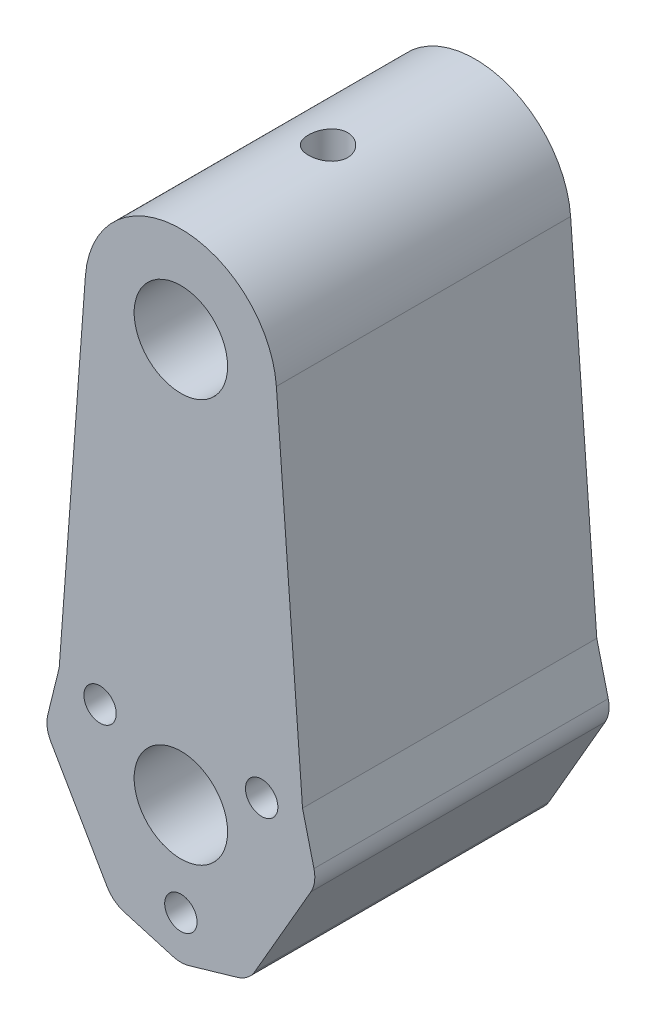
ISO-10303-21;
HEADER;
FILE_DESCRIPTION(('STEP AP214'),'2;1');
FILE_NAME('part.step','',(''),(''),'','','');
FILE_SCHEMA(('AUTOMOTIVE_DESIGN { 1 0 10303 214 1 1 1 1 }'));
ENDSEC;
DATA;
#1=APPLICATION_CONTEXT('core data for automotive mechanical design processes');
#2=APPLICATION_PROTOCOL_DEFINITION('international standard','automotive_design',2000,#1);
#3=PRODUCT_CONTEXT('',#1,'mechanical');
#4=PRODUCT('Part','Part','',(#3));
#5=PRODUCT_RELATED_PRODUCT_CATEGORY('part','',(#4));
#6=PRODUCT_DEFINITION_FORMATION('','',#4);
#7=PRODUCT_DEFINITION_CONTEXT('part definition',#1,'design');
#8=PRODUCT_DEFINITION('design','',#6,#7);
#9=PRODUCT_DEFINITION_SHAPE('','',#8);
#10=(LENGTH_UNIT() NAMED_UNIT(*) SI_UNIT(.MILLI.,.METRE.));
#11=(NAMED_UNIT(*) PLANE_ANGLE_UNIT() SI_UNIT($,.RADIAN.));
#12=(NAMED_UNIT(*) SI_UNIT($,.STERADIAN.) SOLID_ANGLE_UNIT());
#13=UNCERTAINTY_MEASURE_WITH_UNIT(LENGTH_MEASURE(1.E-05),#10,'distance_accuracy_value','');
#14=(GEOMETRIC_REPRESENTATION_CONTEXT(3) GLOBAL_UNCERTAINTY_ASSIGNED_CONTEXT((#13)) GLOBAL_UNIT_ASSIGNED_CONTEXT((#10,
#11,#12)) REPRESENTATION_CONTEXT('',''));
#15=CARTESIAN_POINT('',(0.,0.,0.));
#16=DIRECTION('',(0.,0.,1.));
#17=DIRECTION('',(1.,0.,0.));
#18=AXIS2_PLACEMENT_3D('',#15,#16,#17);
#19=CARTESIAN_POINT('',(12.3430851764876,6.15997573120771,15.));
#20=DIRECTION('',(-0.97112382985435,-0.238575998560248,0.));
#21=DIRECTION('',(0.238575998560248,-0.97112382985435,0.));
#22=AXIS2_PLACEMENT_3D('',#19,#20,#21);
#23=PLANE('',#22);
#24=DIRECTION('',(0.,0.,-1.));
#25=VECTOR('',#24,1.);
#26=CARTESIAN_POINT('',(12.4029017218985,5.91649242601915,15.));
#27=LINE('',#26,#25);
#28=CARTESIAN_POINT('',(12.4029017218985,5.91649242601915,15.));
#29=VERTEX_POINT('',#28);
#30=CARTESIAN_POINT('',(12.4029017218985,5.91649242601915,-15.));
#31=VERTEX_POINT('',#30);
#32=EDGE_CURVE('E11',#29,#31,#27,.T.);
#33=ORIENTED_EDGE('',*,*,#32,.F.);
#34=DIRECTION('',(-0.238575998560248,0.97112382985435,0.));
#35=VECTOR('',#34,1.);
#36=CARTESIAN_POINT('',(12.3430851764876,6.15997573120771,15.));
#37=LINE('',#36,#35);
#38=CARTESIAN_POINT('',(13.5686674410809,1.17124195339267,15.));
#39=VERTEX_POINT('',#38);
#40=EDGE_CURVE('E147',#39,#29,#37,.T.);
#41=ORIENTED_EDGE('',*,*,#40,.F.);
#42=DIRECTION('',(0.,0.,-1.));
#43=VECTOR('',#42,1.);
#44=CARTESIAN_POINT('',(13.5686674410809,1.17124195339267,15.));
#45=LINE('',#44,#43);
#46=CARTESIAN_POINT('',(13.5686674410809,1.17124195339267,-15.));
#47=VERTEX_POINT('',#46);
#48=EDGE_CURVE('E258',#39,#47,#45,.T.);
#49=ORIENTED_EDGE('',*,*,#48,.T.);
#50=DIRECTION('',(-0.238575998560248,0.97112382985435,0.));
#51=VECTOR('',#50,1.);
#52=CARTESIAN_POINT('',(12.3430851764876,6.15997573120771,-15.));
#53=LINE('',#52,#51);
#54=EDGE_CURVE('E59',#47,#31,#53,.T.);
#55=ORIENTED_EDGE('',*,*,#54,.T.);
#56=EDGE_LOOP('',(#33,#41,#49,#55));
#57=FACE_BOUND('',#56,.T.);
#58=ADVANCED_FACE('F41',(#57),#23,.F.);
#59=CARTESIAN_POINT('',(-12.3430851764877,6.15997573120775,15.));
#60=DIRECTION('',(0.971123829854353,-0.238575998560237,0.));
#61=DIRECTION('',(0.238575998560237,0.971123829854353,0.));
#62=AXIS2_PLACEMENT_3D('',#59,#60,#61);
#63=PLANE('',#62);
#64=DIRECTION('',(0.,0.,1.));
#65=VECTOR('',#64,1.);
#66=CARTESIAN_POINT('',(-12.4029017218986,5.91649242601921,15.));
#67=LINE('',#66,#65);
#68=CARTESIAN_POINT('',(-12.4029017218986,5.91649242601921,-15.));
#69=VERTEX_POINT('',#68);
#70=CARTESIAN_POINT('',(-12.4029017218986,5.91649242601921,15.));
#71=VERTEX_POINT('',#70);
#72=EDGE_CURVE('E49',#69,#71,#67,.T.);
#73=ORIENTED_EDGE('',*,*,#72,.F.);
#74=DIRECTION('',(-0.238575998560237,-0.971123829854353,0.));
#75=VECTOR('',#74,1.);
#76=CARTESIAN_POINT('',(-12.3430851764877,6.15997573120775,-15.));
#77=LINE('',#76,#75);
#78=CARTESIAN_POINT('',(-13.568667441081,1.1712419533927,-15.));
#79=VERTEX_POINT('',#78);
#80=EDGE_CURVE('E235',#69,#79,#77,.T.);
#81=ORIENTED_EDGE('',*,*,#80,.T.);
#82=DIRECTION('',(0.,0.,-1.));
#83=VECTOR('',#82,1.);
#84=CARTESIAN_POINT('',(-13.568667441081,1.1712419533927,15.));
#85=LINE('',#84,#83);
#86=CARTESIAN_POINT('',(-13.568667441081,1.1712419533927,15.));
#87=VERTEX_POINT('',#86);
#88=EDGE_CURVE('E255',#87,#79,#85,.T.);
#89=ORIENTED_EDGE('',*,*,#88,.F.);
#90=DIRECTION('',(-0.238575998560237,-0.971123829854353,0.));
#91=VECTOR('',#90,1.);
#92=CARTESIAN_POINT('',(-12.3430851764877,6.15997573120775,15.));
#93=LINE('',#92,#91);
#94=EDGE_CURVE('E213',#71,#87,#93,.T.);
#95=ORIENTED_EDGE('',*,*,#94,.F.);
#96=EDGE_LOOP('',(#73,#81,#89,#95));
#97=FACE_BOUND('',#96,.T.);
#98=ADVANCED_FACE('F280',(#97),#63,.F.);
#99=CARTESIAN_POINT('',(0.,-10.888495471054,15.));
#100=DIRECTION('',(0.,0.,1.));
#101=DIRECTION('',(1.,0.,0.));
#102=AXIS2_PLACEMENT_3D('',#99,#100,#101);
#103=PLANE('',#102);
#104=ORIENTED_EDGE('',*,*,#40,.T.);
#105=DIRECTION('',(-0.0740700617562454,0.997253040081316,0.));
#106=VECTOR('',#105,1.);
#107=CARTESIAN_POINT('',(9.73568280379385,41.8269819217025,15.));
#108=LINE('',#107,#106);
#109=CARTESIAN_POINT('',(9.73568280379385,41.8269819217025,15.));
#110=VERTEX_POINT('',#109);
#111=EDGE_CURVE('E139',#29,#110,#108,.T.);
#112=ORIENTED_EDGE('',*,*,#111,.T.);
#113=CARTESIAN_POINT('',(0.,41.1038729438073,15.));
#114=DIRECTION('',(0.,0.,1.));
#115=DIRECTION('',(-1.,0.,0.));
#116=AXIS2_PLACEMENT_3D('',#113,#114,#115);
#117=CIRCLE('',#116,9.7625);
#118=CARTESIAN_POINT('',(-9.73568280379384,41.8269819217027,15.));
#119=VERTEX_POINT('',#118);
#120=EDGE_CURVE('E145',#110,#119,#117,.T.);
#121=ORIENTED_EDGE('',*,*,#120,.T.);
#122=DIRECTION('',(-0.0740700617562473,-0.997253040081315,0.));
#123=VECTOR('',#122,1.);
#124=CARTESIAN_POINT('',(-12.4214728071686,5.66645792079583,15.));
#125=LINE('',#124,#123);
#126=EDGE_CURVE('E164',#119,#71,#125,.T.);
#127=ORIENTED_EDGE('',*,*,#126,.T.);
#128=ORIENTED_EDGE('',*,*,#94,.T.);
#129=CARTESIAN_POINT('',(-10.6552959515179,0.455513957711989,15.));
#130=DIRECTION('',(0.,0.,1.));
#131=DIRECTION('',(-1.,0.,0.));
#132=AXIS2_PLACEMENT_3D('',#129,#130,#131);
#133=CIRCLE('',#132,3.);
#134=CARTESIAN_POINT('',(-13.2533721628712,-1.04448604228801,15.));
#135=VERTEX_POINT('',#134);
#136=EDGE_CURVE('E215',#87,#135,#133,.T.);
#137=ORIENTED_EDGE('',*,*,#136,.T.);
#138=DIRECTION('',(0.499999999999999,-0.866025403784439,0.));
#139=VECTOR('',#138,1.);
#140=CARTESIAN_POINT('',(-13.2533721628712,-1.04448604228801,15.));
#141=LINE('',#140,#139);
#142=CARTESIAN_POINT('',(-7.53123752795533,-10.955513957712,15.));
#143=VERTEX_POINT('',#142);
#144=EDGE_CURVE('E217',#135,#143,#141,.T.);
#145=ORIENTED_EDGE('',*,*,#144,.T.);
#146=CARTESIAN_POINT('',(-4.93316131660201,-9.45551395771196,15.));
#147=DIRECTION('',(0.,0.,1.));
#148=DIRECTION('',(1.,0.,0.));
#149=AXIS2_PLACEMENT_3D('',#146,#147,#148);
#150=CIRCLE('',#149,3.);
#151=CARTESIAN_POINT('',(-5.77000843492431,-12.3364316761752,15.));
#152=VERTEX_POINT('',#151);
#153=EDGE_CURVE('E219',#143,#152,#150,.T.);
#154=ORIENTED_EDGE('',*,*,#153,.T.);
#155=DIRECTION('',(0.960305906154426,-0.278949039440769,0.));
#156=VECTOR('',#155,1.);
#157=CARTESIAN_POINT('',(-5.77000843492431,-12.3364316761752,15.));
#158=LINE('',#157,#156);
#159=CARTESIAN_POINT('',(-0.836847118322318,-13.7694131895173,15.));
#160=VERTEX_POINT('',#159);
#161=EDGE_CURVE('E221',#152,#160,#158,.T.);
#162=ORIENTED_EDGE('',*,*,#161,.T.);
#163=CARTESIAN_POINT('',(0.,-10.888495471054,15.));
#164=DIRECTION('',(0.,0.,1.));
#165=DIRECTION('',(1.,0.,0.));
#166=AXIS2_PLACEMENT_3D('',#163,#164,#165);
#167=CIRCLE('',#166,3.);
#168=CARTESIAN_POINT('',(0.836847118322291,-13.7694131895173,15.));
#169=VERTEX_POINT('',#168);
#170=EDGE_CURVE('E200',#160,#169,#167,.T.);
#171=ORIENTED_EDGE('',*,*,#170,.T.);
#172=DIRECTION('',(0.960305906154426,0.278949039440768,0.));
#173=VECTOR('',#172,1.);
#174=CARTESIAN_POINT('',(0.836847118322291,-13.7694131895173,15.));
#175=LINE('',#174,#173);
#176=CARTESIAN_POINT('',(5.77000843492429,-12.3364316761752,15.));
#177=VERTEX_POINT('',#176);
#178=EDGE_CURVE('E203',#169,#177,#175,.T.);
#179=ORIENTED_EDGE('',*,*,#178,.T.);
#180=CARTESIAN_POINT('',(4.93316131660199,-9.45551395771197,15.));
#181=DIRECTION('',(0.,0.,1.));
#182=DIRECTION('',(1.,0.,0.));
#183=AXIS2_PLACEMENT_3D('',#180,#181,#182);
#184=CIRCLE('',#183,3.);
#185=CARTESIAN_POINT('',(7.5312375279553,-10.955513957712,15.));
#186=VERTEX_POINT('',#185);
#187=EDGE_CURVE('E206',#177,#186,#184,.T.);
#188=ORIENTED_EDGE('',*,*,#187,.T.);
#189=DIRECTION('',(0.500000000000001,0.866025403784438,0.));
#190=VECTOR('',#189,1.);
#191=CARTESIAN_POINT('',(7.5312375279553,-10.955513957712,15.));
#192=LINE('',#191,#190);
#193=CARTESIAN_POINT('',(13.2533721628712,-1.04448604228807,15.));
#194=VERTEX_POINT('',#193);
#195=EDGE_CURVE('E208',#186,#194,#192,.T.);
#196=ORIENTED_EDGE('',*,*,#195,.T.);
#197=CARTESIAN_POINT('',(10.6552959515179,0.455513957711929,15.));
#198=DIRECTION('',(0.,0.,1.));
#199=DIRECTION('',(1.,0.,0.));
#200=AXIS2_PLACEMENT_3D('',#197,#198,#199);
#201=CIRCLE('',#200,3.);
#202=EDGE_CURVE('E210',#194,#39,#201,.T.);
#203=ORIENTED_EDGE('',*,*,#202,.T.);
#204=EDGE_LOOP('',(#104,#112,#121,#127,#128,#137,#145,#154,#162,#171,#179,#188,#196,#203));
#205=FACE_BOUND('',#204,.T.);
#206=CARTESIAN_POINT('',(0.,41.1038729438073,15.));
#207=DIRECTION('',(0.,0.,1.));
#208=DIRECTION('',(1.,0.,0.));
#209=AXIS2_PLACEMENT_3D('',#206,#207,#208);
#210=CIRCLE('',#209,4.7625);
#211=CARTESIAN_POINT('',(4.7625,41.1038729438073,15.));
#212=VERTEX_POINT('',#211);
#213=EDGE_CURVE('E171',#212,#212,#210,.T.);
#214=ORIENTED_EDGE('',*,*,#213,.F.);
#215=EDGE_LOOP('',(#214));
#216=FACE_BOUND('',#215,.T.);
#217=CARTESIAN_POINT('',(8.23806665349945,4.75625000000004,15.));
#218=DIRECTION('',(0.,0.,1.));
#219=DIRECTION('',(1.,0.,0.));
#220=AXIS2_PLACEMENT_3D('',#217,#218,#219);
#221=CIRCLE('',#220,1.65);
#222=CARTESIAN_POINT('',(9.88806665349945,4.75625000000004,15.));
#223=VERTEX_POINT('',#222);
#224=EDGE_CURVE('E182',#223,#223,#221,.T.);
#225=ORIENTED_EDGE('',*,*,#224,.F.);
#226=EDGE_LOOP('',(#225));
#227=FACE_BOUND('',#226,.T.);
#228=CARTESIAN_POINT('',(0.,0.,15.));
#229=DIRECTION('',(0.,0.,1.));
#230=DIRECTION('',(1.,0.,0.));
#231=AXIS2_PLACEMENT_3D('',#228,#229,#230);
#232=CIRCLE('',#231,4.7625);
#233=CARTESIAN_POINT('',(4.7625,0.,15.));
#234=VERTEX_POINT('',#233);
#235=EDGE_CURVE('E194',#234,#234,#232,.T.);
#236=ORIENTED_EDGE('',*,*,#235,.F.);
#237=EDGE_LOOP('',(#236));
#238=FACE_BOUND('',#237,.T.);
#239=CARTESIAN_POINT('',(-8.23806665349949,4.75624999999998,15.));
#240=DIRECTION('',(0.,0.,1.));
#241=DIRECTION('',(1.,0.,0.));
#242=AXIS2_PLACEMENT_3D('',#239,#240,#241);
#243=CIRCLE('',#242,1.65);
#244=CARTESIAN_POINT('',(-6.58806665349948,4.75624999999998,15.));
#245=VERTEX_POINT('',#244);
#246=EDGE_CURVE('E188',#245,#245,#243,.T.);
#247=ORIENTED_EDGE('',*,*,#246,.F.);
#248=EDGE_LOOP('',(#247));
#249=FACE_BOUND('',#248,.T.);
#250=CARTESIAN_POINT('',(0.,-9.5125,15.));
#251=DIRECTION('',(0.,0.,1.));
#252=DIRECTION('',(1.,0.,0.));
#253=AXIS2_PLACEMENT_3D('',#250,#251,#252);
#254=CIRCLE('',#253,1.65);
#255=CARTESIAN_POINT('',(1.65,-9.5125,15.));
#256=VERTEX_POINT('',#255);
#257=EDGE_CURVE('E176',#256,#256,#254,.T.);
#258=ORIENTED_EDGE('',*,*,#257,.F.);
#259=EDGE_LOOP('',(#258));
#260=FACE_BOUND('',#259,.T.);
#261=ADVANCED_FACE('F141',(#205,#216,#227,#238,#249,#260),#103,.T.);
#262=CARTESIAN_POINT('',(0.,-10.888495471054,-15.));
#263=DIRECTION('',(0.,0.,1.));
#264=DIRECTION('',(1.,0.,0.));
#265=AXIS2_PLACEMENT_3D('',#262,#263,#264);
#266=PLANE('',#265);
#267=DIRECTION('',(-0.0740700617562454,0.997253040081316,0.));
#268=VECTOR('',#267,1.);
#269=CARTESIAN_POINT('',(9.73568280379385,41.8269819217025,-15.));
#270=LINE('',#269,#268);
#271=CARTESIAN_POINT('',(9.73568280379385,41.8269819217025,-15.));
#272=VERTEX_POINT('',#271);
#273=EDGE_CURVE('E155',#31,#272,#270,.T.);
#274=ORIENTED_EDGE('',*,*,#273,.F.);
#275=ORIENTED_EDGE('',*,*,#54,.F.);
#276=CARTESIAN_POINT('',(10.6552959515179,0.455513957711929,-15.));
#277=DIRECTION('',(0.,0.,1.));
#278=DIRECTION('',(1.,0.,0.));
#279=AXIS2_PLACEMENT_3D('',#276,#277,#278);
#280=CIRCLE('',#279,3.);
#281=CARTESIAN_POINT('',(13.2533721628712,-1.04448604228807,-15.));
#282=VERTEX_POINT('',#281);
#283=EDGE_CURVE('E232',#282,#47,#280,.T.);
#284=ORIENTED_EDGE('',*,*,#283,.F.);
#285=DIRECTION('',(0.500000000000001,0.866025403784438,0.));
#286=VECTOR('',#285,1.);
#287=CARTESIAN_POINT('',(7.5312375279553,-10.955513957712,-15.));
#288=LINE('',#287,#286);
#289=CARTESIAN_POINT('',(7.5312375279553,-10.955513957712,-15.));
#290=VERTEX_POINT('',#289);
#291=EDGE_CURVE('E230',#290,#282,#288,.T.);
#292=ORIENTED_EDGE('',*,*,#291,.F.);
#293=CARTESIAN_POINT('',(4.93316131660199,-9.45551395771197,-15.));
#294=DIRECTION('',(0.,0.,1.));
#295=DIRECTION('',(1.,0.,0.));
#296=AXIS2_PLACEMENT_3D('',#293,#294,#295);
#297=CIRCLE('',#296,3.);
#298=CARTESIAN_POINT('',(5.77000843492429,-12.3364316761752,-15.));
#299=VERTEX_POINT('',#298);
#300=EDGE_CURVE('E228',#299,#290,#297,.T.);
#301=ORIENTED_EDGE('',*,*,#300,.F.);
#302=DIRECTION('',(0.960305906154426,0.278949039440768,0.));
#303=VECTOR('',#302,1.);
#304=CARTESIAN_POINT('',(0.836847118322291,-13.7694131895173,-15.));
#305=LINE('',#304,#303);
#306=CARTESIAN_POINT('',(0.836847118322291,-13.7694131895173,-15.));
#307=VERTEX_POINT('',#306);
#308=EDGE_CURVE('E226',#307,#299,#305,.T.);
#309=ORIENTED_EDGE('',*,*,#308,.F.);
#310=CARTESIAN_POINT('',(0.,-10.888495471054,-15.));
#311=DIRECTION('',(0.,0.,1.));
#312=DIRECTION('',(1.,0.,0.));
#313=AXIS2_PLACEMENT_3D('',#310,#311,#312);
#314=CIRCLE('',#313,3.);
#315=CARTESIAN_POINT('',(-0.836847118322318,-13.7694131895173,-15.));
#316=VERTEX_POINT('',#315);
#317=EDGE_CURVE('E197',#316,#307,#314,.T.);
#318=ORIENTED_EDGE('',*,*,#317,.F.);
#319=DIRECTION('',(0.960305906154426,-0.278949039440769,0.));
#320=VECTOR('',#319,1.);
#321=CARTESIAN_POINT('',(-5.77000843492431,-12.3364316761752,-15.));
#322=LINE('',#321,#320);
#323=CARTESIAN_POINT('',(-5.77000843492431,-12.3364316761752,-15.));
#324=VERTEX_POINT('',#323);
#325=EDGE_CURVE('E204',#324,#316,#322,.T.);
#326=ORIENTED_EDGE('',*,*,#325,.F.);
#327=CARTESIAN_POINT('',(-4.93316131660201,-9.45551395771196,-15.));
#328=DIRECTION('',(0.,0.,1.));
#329=DIRECTION('',(1.,0.,0.));
#330=AXIS2_PLACEMENT_3D('',#327,#328,#329);
#331=CIRCLE('',#330,3.);
#332=CARTESIAN_POINT('',(-7.53123752795533,-10.955513957712,-15.));
#333=VERTEX_POINT('',#332);
#334=EDGE_CURVE('E241',#333,#324,#331,.T.);
#335=ORIENTED_EDGE('',*,*,#334,.F.);
#336=DIRECTION('',(0.499999999999999,-0.866025403784439,0.));
#337=VECTOR('',#336,1.);
#338=CARTESIAN_POINT('',(-13.2533721628712,-1.04448604228801,-15.));
#339=LINE('',#338,#337);
#340=CARTESIAN_POINT('',(-13.2533721628712,-1.04448604228801,-15.));
#341=VERTEX_POINT('',#340);
#342=EDGE_CURVE('E239',#341,#333,#339,.T.);
#343=ORIENTED_EDGE('',*,*,#342,.F.);
#344=CARTESIAN_POINT('',(-10.6552959515179,0.455513957711989,-15.));
#345=DIRECTION('',(0.,0.,1.));
#346=DIRECTION('',(-1.,0.,0.));
#347=AXIS2_PLACEMENT_3D('',#344,#345,#346);
#348=CIRCLE('',#347,3.);
#349=EDGE_CURVE('E237',#79,#341,#348,.T.);
#350=ORIENTED_EDGE('',*,*,#349,.F.);
#351=ORIENTED_EDGE('',*,*,#80,.F.);
#352=DIRECTION('',(-0.0740700617562473,-0.997253040081315,0.));
#353=VECTOR('',#352,1.);
#354=CARTESIAN_POINT('',(-12.4214728071686,5.66645792079583,-15.));
#355=LINE('',#354,#353);
#356=CARTESIAN_POINT('',(-9.73568280379384,41.8269819217027,-15.));
#357=VERTEX_POINT('',#356);
#358=EDGE_CURVE('E149',#357,#69,#355,.T.);
#359=ORIENTED_EDGE('',*,*,#358,.F.);
#360=CARTESIAN_POINT('',(0.,41.1038729438073,-15.));
#361=DIRECTION('',(0.,0.,1.));
#362=DIRECTION('',(-1.,0.,0.));
#363=AXIS2_PLACEMENT_3D('',#360,#361,#362);
#364=CIRCLE('',#363,9.7625);
#365=EDGE_CURVE('E170',#272,#357,#364,.T.);
#366=ORIENTED_EDGE('',*,*,#365,.F.);
#367=EDGE_LOOP('',(#274,#275,#284,#292,#301,#309,#318,#326,#335,#343,#350,#351,#359,#366));
#368=FACE_BOUND('',#367,.T.);
#369=CARTESIAN_POINT('',(0.,41.1038729438073,-15.));
#370=DIRECTION('',(0.,0.,1.));
#371=DIRECTION('',(1.,0.,0.));
#372=AXIS2_PLACEMENT_3D('',#369,#370,#371);
#373=CIRCLE('',#372,4.7625);
#374=CARTESIAN_POINT('',(4.7625,41.1038729438073,-15.));
#375=VERTEX_POINT('',#374);
#376=EDGE_CURVE('E503',#375,#375,#373,.T.);
#377=ORIENTED_EDGE('',*,*,#376,.T.);
#378=EDGE_LOOP('',(#377));
#379=FACE_BOUND('',#378,.T.);
#380=CARTESIAN_POINT('',(0.,0.,-15.));
#381=DIRECTION('',(0.,0.,1.));
#382=DIRECTION('',(1.,0.,0.));
#383=AXIS2_PLACEMENT_3D('',#380,#381,#382);
#384=CIRCLE('',#383,4.7625);
#385=CARTESIAN_POINT('',(4.7625,0.,-15.));
#386=VERTEX_POINT('',#385);
#387=EDGE_CURVE('E191',#386,#386,#384,.T.);
#388=ORIENTED_EDGE('',*,*,#387,.T.);
#389=EDGE_LOOP('',(#388));
#390=FACE_BOUND('',#389,.T.);
#391=CARTESIAN_POINT('',(-8.23806665349949,4.75624999999998,-15.));
#392=DIRECTION('',(0.,0.,1.));
#393=DIRECTION('',(1.,0.,0.));
#394=AXIS2_PLACEMENT_3D('',#391,#392,#393);
#395=CIRCLE('',#394,1.65);
#396=CARTESIAN_POINT('',(-6.58806665349948,4.75624999999998,-15.));
#397=VERTEX_POINT('',#396);
#398=EDGE_CURVE('E185',#397,#397,#395,.T.);
#399=ORIENTED_EDGE('',*,*,#398,.T.);
#400=EDGE_LOOP('',(#399));
#401=FACE_BOUND('',#400,.T.);
#402=CARTESIAN_POINT('',(8.23806665349945,4.75625000000004,-15.));
#403=DIRECTION('',(0.,0.,1.));
#404=DIRECTION('',(1.,0.,0.));
#405=AXIS2_PLACEMENT_3D('',#402,#403,#404);
#406=CIRCLE('',#405,1.65);
#407=CARTESIAN_POINT('',(9.88806665349945,4.75625000000004,-15.));
#408=VERTEX_POINT('',#407);
#409=EDGE_CURVE('E179',#408,#408,#406,.T.);
#410=ORIENTED_EDGE('',*,*,#409,.T.);
#411=EDGE_LOOP('',(#410));
#412=FACE_BOUND('',#411,.T.);
#413=CARTESIAN_POINT('',(0.,-9.5125,-15.));
#414=DIRECTION('',(0.,0.,1.));
#415=DIRECTION('',(1.,0.,0.));
#416=AXIS2_PLACEMENT_3D('',#413,#414,#415);
#417=CIRCLE('',#416,1.65);
#418=CARTESIAN_POINT('',(1.65,-9.5125,-15.));
#419=VERTEX_POINT('',#418);
#420=EDGE_CURVE('E158',#419,#419,#417,.T.);
#421=ORIENTED_EDGE('',*,*,#420,.T.);
#422=EDGE_LOOP('',(#421));
#423=FACE_BOUND('',#422,.T.);
#424=ADVANCED_FACE('F339',(#368,#379,#390,#401,#412,#423),#266,.F.);
#425=CARTESIAN_POINT('',(0.,-10.888495471054,15.));
#426=DIRECTION('',(0.,0.,-1.));
#427=DIRECTION('',(-1.,0.,0.));
#428=AXIS2_PLACEMENT_3D('',#425,#426,#427);
#429=CYLINDRICAL_SURFACE('',#428,3.);
#430=ORIENTED_EDGE('',*,*,#317,.T.);
#431=DIRECTION('',(0.,0.,-1.));
#432=VECTOR('',#431,1.);
#433=CARTESIAN_POINT('',(0.836847118322291,-13.7694131895173,15.));
#434=LINE('',#433,#432);
#435=EDGE_CURVE('E269',#169,#307,#434,.T.);
#436=ORIENTED_EDGE('',*,*,#435,.F.);
#437=ORIENTED_EDGE('',*,*,#170,.F.);
#438=DIRECTION('',(0.,0.,-1.));
#439=VECTOR('',#438,1.);
#440=CARTESIAN_POINT('',(-0.836847118322318,-13.7694131895173,15.));
#441=LINE('',#440,#439);
#442=EDGE_CURVE('E223',#160,#316,#441,.T.);
#443=ORIENTED_EDGE('',*,*,#442,.T.);
#444=EDGE_LOOP('',(#430,#436,#437,#443));
#445=FACE_BOUND('',#444,.T.);
#446=ADVANCED_FACE('F43',(#445),#429,.T.);
#447=CARTESIAN_POINT('',(0.836847118322291,-13.7694131895173,15.));
#448=DIRECTION('',(-0.278949039440768,0.960305906154426,0.));
#449=DIRECTION('',(-0.960305906154426,-0.278949039440768,0.));
#450=AXIS2_PLACEMENT_3D('',#447,#448,#449);
#451=PLANE('',#450);
#452=ORIENTED_EDGE('',*,*,#308,.T.);
#453=DIRECTION('',(0.,0.,-1.));
#454=VECTOR('',#453,1.);
#455=CARTESIAN_POINT('',(5.77000843492429,-12.3364316761752,15.));
#456=LINE('',#455,#454);
#457=EDGE_CURVE('E266',#177,#299,#456,.T.);
#458=ORIENTED_EDGE('',*,*,#457,.F.);
#459=ORIENTED_EDGE('',*,*,#178,.F.);
#460=ORIENTED_EDGE('',*,*,#435,.T.);
#461=EDGE_LOOP('',(#452,#458,#459,#460));
#462=FACE_BOUND('',#461,.T.);
#463=ADVANCED_FACE('F307',(#462),#451,.F.);
#464=CARTESIAN_POINT('',(4.93316131660199,-9.45551395771197,15.));
#465=DIRECTION('',(0.,0.,-1.));
#466=DIRECTION('',(-1.,0.,0.));
#467=AXIS2_PLACEMENT_3D('',#464,#465,#466);
#468=CYLINDRICAL_SURFACE('',#467,3.);
#469=ORIENTED_EDGE('',*,*,#300,.T.);
#470=DIRECTION('',(0.,0.,-1.));
#471=VECTOR('',#470,1.);
#472=CARTESIAN_POINT('',(7.5312375279553,-10.955513957712,15.));
#473=LINE('',#472,#471);
#474=EDGE_CURVE('E263',#186,#290,#473,.T.);
#475=ORIENTED_EDGE('',*,*,#474,.F.);
#476=ORIENTED_EDGE('',*,*,#187,.F.);
#477=ORIENTED_EDGE('',*,*,#457,.T.);
#478=EDGE_LOOP('',(#469,#475,#476,#477));
#479=FACE_BOUND('',#478,.T.);
#480=ADVANCED_FACE('F310',(#479),#468,.T.);
#481=CARTESIAN_POINT('',(7.5312375279553,-10.955513957712,15.));
#482=DIRECTION('',(-0.866025403784438,0.500000000000001,0.));
#483=DIRECTION('',(-0.500000000000001,-0.866025403784438,0.));
#484=AXIS2_PLACEMENT_3D('',#481,#482,#483);
#485=PLANE('',#484);
#486=ORIENTED_EDGE('',*,*,#291,.T.);
#487=DIRECTION('',(0.,0.,-1.));
#488=VECTOR('',#487,1.);
#489=CARTESIAN_POINT('',(13.2533721628712,-1.04448604228807,15.));
#490=LINE('',#489,#488);
#491=EDGE_CURVE('E260',#194,#282,#490,.T.);
#492=ORIENTED_EDGE('',*,*,#491,.F.);
#493=ORIENTED_EDGE('',*,*,#195,.F.);
#494=ORIENTED_EDGE('',*,*,#474,.T.);
#495=EDGE_LOOP('',(#486,#492,#493,#494));
#496=FACE_BOUND('',#495,.T.);
#497=ADVANCED_FACE('F315',(#496),#485,.F.);
#498=CARTESIAN_POINT('',(10.6552959515179,0.455513957711929,15.));
#499=DIRECTION('',(0.,0.,-1.));
#500=DIRECTION('',(-1.,0.,0.));
#501=AXIS2_PLACEMENT_3D('',#498,#499,#500);
#502=CYLINDRICAL_SURFACE('',#501,3.);
#503=ORIENTED_EDGE('',*,*,#283,.T.);
#504=ORIENTED_EDGE('',*,*,#48,.F.);
#505=ORIENTED_EDGE('',*,*,#202,.F.);
#506=ORIENTED_EDGE('',*,*,#491,.T.);
#507=EDGE_LOOP('',(#503,#504,#505,#506));
#508=FACE_BOUND('',#507,.T.);
#509=ADVANCED_FACE('F319',(#508),#502,.T.);
#510=CARTESIAN_POINT('',(-10.6552959515179,0.455513957711989,15.));
#511=DIRECTION('',(0.,0.,-1.));
#512=DIRECTION('',(-1.,0.,0.));
#513=AXIS2_PLACEMENT_3D('',#510,#511,#512);
#514=CYLINDRICAL_SURFACE('',#513,3.);
#515=ORIENTED_EDGE('',*,*,#349,.T.);
#516=DIRECTION('',(0.,0.,-1.));
#517=VECTOR('',#516,1.);
#518=CARTESIAN_POINT('',(-13.2533721628712,-1.04448604228801,15.));
#519=LINE('',#518,#517);
#520=EDGE_CURVE('E252',#135,#341,#519,.T.);
#521=ORIENTED_EDGE('',*,*,#520,.F.);
#522=ORIENTED_EDGE('',*,*,#136,.F.);
#523=ORIENTED_EDGE('',*,*,#88,.T.);
#524=EDGE_LOOP('',(#515,#521,#522,#523));
#525=FACE_BOUND('',#524,.T.);
#526=ADVANCED_FACE('F283',(#525),#514,.T.);
#527=CARTESIAN_POINT('',(-13.2533721628712,-1.04448604228801,15.));
#528=DIRECTION('',(0.866025403784439,0.499999999999999,0.));
#529=DIRECTION('',(-0.499999999999999,0.866025403784439,0.));
#530=AXIS2_PLACEMENT_3D('',#527,#528,#529);
#531=PLANE('',#530);
#532=ORIENTED_EDGE('',*,*,#342,.T.);
#533=DIRECTION('',(0.,0.,-1.));
#534=VECTOR('',#533,1.);
#535=CARTESIAN_POINT('',(-7.53123752795533,-10.955513957712,15.));
#536=LINE('',#535,#534);
#537=EDGE_CURVE('E249',#143,#333,#536,.T.);
#538=ORIENTED_EDGE('',*,*,#537,.F.);
#539=ORIENTED_EDGE('',*,*,#144,.F.);
#540=ORIENTED_EDGE('',*,*,#520,.T.);
#541=EDGE_LOOP('',(#532,#538,#539,#540));
#542=FACE_BOUND('',#541,.T.);
#543=ADVANCED_FACE('F288',(#542),#531,.F.);
#544=CARTESIAN_POINT('',(-4.93316131660201,-9.45551395771196,15.));
#545=DIRECTION('',(0.,0.,-1.));
#546=DIRECTION('',(-1.,0.,0.));
#547=AXIS2_PLACEMENT_3D('',#544,#545,#546);
#548=CYLINDRICAL_SURFACE('',#547,3.);
#549=ORIENTED_EDGE('',*,*,#334,.T.);
#550=DIRECTION('',(0.,0.,-1.));
#551=VECTOR('',#550,1.);
#552=CARTESIAN_POINT('',(-5.77000843492431,-12.3364316761752,15.));
#553=LINE('',#552,#551);
#554=EDGE_CURVE('E246',#152,#324,#553,.T.);
#555=ORIENTED_EDGE('',*,*,#554,.F.);
#556=ORIENTED_EDGE('',*,*,#153,.F.);
#557=ORIENTED_EDGE('',*,*,#537,.T.);
#558=EDGE_LOOP('',(#549,#555,#556,#557));
#559=FACE_BOUND('',#558,.T.);
#560=ADVANCED_FACE('F294',(#559),#548,.T.);
#561=CARTESIAN_POINT('',(-5.77000843492431,-12.3364316761752,15.));
#562=DIRECTION('',(0.278949039440769,0.960305906154426,0.));
#563=DIRECTION('',(-0.960305906154426,0.278949039440769,0.));
#564=AXIS2_PLACEMENT_3D('',#561,#562,#563);
#565=PLANE('',#564);
#566=ORIENTED_EDGE('',*,*,#325,.T.);
#567=ORIENTED_EDGE('',*,*,#442,.F.);
#568=ORIENTED_EDGE('',*,*,#161,.F.);
#569=ORIENTED_EDGE('',*,*,#554,.T.);
#570=EDGE_LOOP('',(#566,#567,#568,#569));
#571=FACE_BOUND('',#570,.T.);
#572=ADVANCED_FACE('F298',(#571),#565,.F.);
#573=CARTESIAN_POINT('',(0.,0.,15.));
#574=DIRECTION('',(0.,0.,-1.));
#575=DIRECTION('',(-1.,0.,0.));
#576=AXIS2_PLACEMENT_3D('',#573,#574,#575);
#577=CYLINDRICAL_SURFACE('',#576,4.7625);
#578=ORIENTED_EDGE('',*,*,#235,.T.);
#579=EDGE_LOOP('',(#578));
#580=FACE_BOUND('',#579,.T.);
#581=ORIENTED_EDGE('',*,*,#387,.F.);
#582=EDGE_LOOP('',(#581));
#583=FACE_BOUND('',#582,.T.);
#584=ADVANCED_FACE('F355',(#580,#583),#577,.F.);
#585=CARTESIAN_POINT('',(-8.23806665349949,4.75624999999998,15.));
#586=DIRECTION('',(0.,0.,-1.));
#587=DIRECTION('',(-1.,0.,0.));
#588=AXIS2_PLACEMENT_3D('',#585,#586,#587);
#589=CYLINDRICAL_SURFACE('',#588,1.65);
#590=ORIENTED_EDGE('',*,*,#246,.T.);
#591=EDGE_LOOP('',(#590));
#592=FACE_BOUND('',#591,.T.);
#593=ORIENTED_EDGE('',*,*,#398,.F.);
#594=EDGE_LOOP('',(#593));
#595=FACE_BOUND('',#594,.T.);
#596=ADVANCED_FACE('F386',(#592,#595),#589,.F.);
#597=CARTESIAN_POINT('',(8.23806665349945,4.75625000000004,15.));
#598=DIRECTION('',(0.,0.,-1.));
#599=DIRECTION('',(-1.,0.,0.));
#600=AXIS2_PLACEMENT_3D('',#597,#598,#599);
#601=CYLINDRICAL_SURFACE('',#600,1.65);
#602=ORIENTED_EDGE('',*,*,#224,.T.);
#603=EDGE_LOOP('',(#602));
#604=FACE_BOUND('',#603,.T.);
#605=ORIENTED_EDGE('',*,*,#409,.F.);
#606=EDGE_LOOP('',(#605));
#607=FACE_BOUND('',#606,.T.);
#608=ADVANCED_FACE('F394',(#604,#607),#601,.F.);
#609=CARTESIAN_POINT('',(0.,-9.5125,15.));
#610=DIRECTION('',(0.,0.,-1.));
#611=DIRECTION('',(-1.,0.,0.));
#612=AXIS2_PLACEMENT_3D('',#609,#610,#611);
#613=CYLINDRICAL_SURFACE('',#612,1.65);
#614=ORIENTED_EDGE('',*,*,#257,.T.);
#615=EDGE_LOOP('',(#614));
#616=FACE_BOUND('',#615,.T.);
#617=ORIENTED_EDGE('',*,*,#420,.F.);
#618=EDGE_LOOP('',(#617));
#619=FACE_BOUND('',#618,.T.);
#620=ADVANCED_FACE('F402',(#616,#619),#613,.F.);
#621=CARTESIAN_POINT('',(9.73568280379385,41.8269819217025,15.));
#622=DIRECTION('',(-0.997253040081316,-0.0740700617562454,0.));
#623=DIRECTION('',(0.0740700617562454,-0.997253040081316,0.));
#624=AXIS2_PLACEMENT_3D('',#621,#622,#623);
#625=PLANE('',#624);
#626=ORIENTED_EDGE('',*,*,#111,.F.);
#627=ORIENTED_EDGE('',*,*,#32,.T.);
#628=ORIENTED_EDGE('',*,*,#273,.T.);
#629=DIRECTION('',(0.,0.,-1.));
#630=VECTOR('',#629,1.);
#631=CARTESIAN_POINT('',(9.73568280379385,41.8269819217025,15.));
#632=LINE('',#631,#630);
#633=EDGE_CURVE('E152',#110,#272,#632,.T.);
#634=ORIENTED_EDGE('',*,*,#633,.F.);
#635=EDGE_LOOP('',(#626,#627,#628,#634));
#636=FACE_BOUND('',#635,.T.);
#637=ADVANCED_FACE('F153',(#636),#625,.F.);
#638=CARTESIAN_POINT('',(-12.4214728071686,5.66645792079583,15.));
#639=DIRECTION('',(0.997253040081315,-0.0740700617562473,0.));
#640=DIRECTION('',(0.0740700617562473,0.997253040081315,0.));
#641=AXIS2_PLACEMENT_3D('',#638,#639,#640);
#642=PLANE('',#641);
#643=ORIENTED_EDGE('',*,*,#358,.T.);
#644=ORIENTED_EDGE('',*,*,#72,.T.);
#645=ORIENTED_EDGE('',*,*,#126,.F.);
#646=DIRECTION('',(0.,0.,-1.));
#647=VECTOR('',#646,1.);
#648=CARTESIAN_POINT('',(-9.73568280379384,41.8269819217027,15.));
#649=LINE('',#648,#647);
#650=EDGE_CURVE('E159',#119,#357,#649,.T.);
#651=ORIENTED_EDGE('',*,*,#650,.T.);
#652=EDGE_LOOP('',(#643,#644,#645,#651));
#653=FACE_BOUND('',#652,.T.);
#654=ADVANCED_FACE('F273',(#653),#642,.F.);
#655=CARTESIAN_POINT('',(0.,41.1038729438073,15.));
#656=DIRECTION('',(0.,0.,-1.));
#657=DIRECTION('',(-1.,0.,0.));
#658=AXIS2_PLACEMENT_3D('',#655,#656,#657);
#659=CYLINDRICAL_SURFACE('',#658,9.7625);
#660=CARTESIAN_POINT('',(0.,50.8663729438073,2.));
#661=CARTESIAN_POINT('',(0.111096270545489,50.8663708897027,1.99999598237589));
#662=CARTESIAN_POINT('',(0.222242750978251,50.8644571317093,1.99071194232444));
#663=CARTESIAN_POINT('',(0.441390170885254,50.857007427361,1.95385284594981));
#664=CARTESIAN_POINT('',(0.549388606973715,50.8514686762314,1.92626362608736));
#665=CARTESIAN_POINT('',(0.759040095856698,50.8373870188624,1.85368536104701));
#666=CARTESIAN_POINT('',(0.860699253026225,50.8288470569128,1.80871336466158));
#667=CARTESIAN_POINT('',(1.05502317807572,50.809689668082,1.70269768599065));
#668=CARTESIAN_POINT('',(1.14768840421541,50.7990723471299,1.64165482313862));
#669=CARTESIAN_POINT('',(1.32271377765976,50.7767591346319,1.50431323319022));
#670=CARTESIAN_POINT('',(1.40492809008899,50.765051256787,1.42783058663106));
#671=CARTESIAN_POINT('',(1.55545465865683,50.7419629845632,1.26217572955875));
#672=CARTESIAN_POINT('',(1.62376579188251,50.7305826166997,1.17300249505716));
#673=CARTESIAN_POINT('',(1.74517335108151,50.7093205772933,0.983441373152901));
#674=CARTESIAN_POINT('',(1.79811770132923,50.6994543128511,0.882954204908762));
#675=CARTESIAN_POINT('',(1.88631423985942,50.6825082807321,0.67427451029944));
#676=CARTESIAN_POINT('',(1.92156826735882,50.6754282233972,0.566082786293043));
#677=CARTESIAN_POINT('',(1.97290783060349,50.6649777213864,0.346637518191935));
#678=CARTESIAN_POINT('',(1.98924983369709,50.6615576919701,0.235446385154278));
#679=CARTESIAN_POINT('',(2.00309828466899,50.6586653126112,0.0118520223544458));
#680=CARTESIAN_POINT('',(2.00060675561089,50.6591925386615,-0.100551075925404));
#681=CARTESIAN_POINT('',(1.97706598021315,50.6640900890154,-0.321494743199933));
#682=CARTESIAN_POINT('',(1.95631171707468,50.6683993227242,-0.430068298573962));
#683=CARTESIAN_POINT('',(1.89730066371993,50.680279056291,-0.642159111435934));
#684=CARTESIAN_POINT('',(1.85904300060054,50.6878497187971,-0.745676116466248));
#685=CARTESIAN_POINT('',(1.76583221245497,50.7054611757846,-0.945560209532713));
#686=CARTESIAN_POINT('',(1.71076305044425,50.7155190428624,-1.0418716200873));
#687=CARTESIAN_POINT('',(1.58557427561955,50.7369608059205,-1.2239969183631));
#688=CARTESIAN_POINT('',(1.51545285160933,50.748344861402,-1.3098095408422));
#689=CARTESIAN_POINT('',(1.36057516012576,50.7714203275509,-1.4702025395351));
#690=CARTESIAN_POINT('',(1.27556735743573,50.7831134808894,-1.54453999158912));
#691=CARTESIAN_POINT('',(1.09416351739471,50.8052928852535,-1.67793973385202));
#692=CARTESIAN_POINT('',(0.997767319893455,50.8157791193026,-1.73700180921235));
#693=CARTESIAN_POINT('',(0.796046485684007,50.8343909231525,-1.83822294735157));
#694=CARTESIAN_POINT('',(0.690707007592007,50.8425124657823,-1.88035322040159));
#695=CARTESIAN_POINT('',(0.474241593669872,50.8554494227383,-1.94625033332431));
#696=CARTESIAN_POINT('',(0.363116395909465,50.860265257659,-1.97001950937933));
#697=CARTESIAN_POINT('',(0.140320551261761,50.865989285162,-1.99817342197341));
#698=CARTESIAN_POINT('',(0.0286935633109393,50.866964455304,-2.00289044761031));
#699=CARTESIAN_POINT('',(-0.193753469165401,50.865083730412,-1.9937025048477));
#700=CARTESIAN_POINT('',(-0.304573561003624,50.8622280618496,-1.97979863727872));
#701=CARTESIAN_POINT('',(-0.521181737952826,50.8530485272635,-1.93403953639928));
#702=CARTESIAN_POINT('',(-0.627007571019496,50.8467578011727,-1.90235575630572));
#703=CARTESIAN_POINT('',(-0.831844103067045,50.8314112147829,-1.82212431390724));
#704=CARTESIAN_POINT('',(-0.930854272293403,50.8223551398411,-1.77357534250716));
#705=CARTESIAN_POINT('',(-1.12064346969464,50.8023159356318,-1.66027948684931));
#706=CARTESIAN_POINT('',(-1.21130130635044,50.791309685088,-1.5953337640621));
#707=CARTESIAN_POINT('',(-1.38055115683262,50.7686434620477,-1.45135309377027));
#708=CARTESIAN_POINT('',(-1.45914180678819,50.7569834158601,-1.37231655585657));
#709=CARTESIAN_POINT('',(-1.60331678317282,50.7340965751494,-1.20088193776066));
#710=CARTESIAN_POINT('',(-1.66867247222937,50.7228797192939,-1.10829001533239));
#711=CARTESIAN_POINT('',(-1.78290481866831,50.7023644241991,-0.913247569060954));
#712=CARTESIAN_POINT('',(-1.83178215151766,50.693065906331,-0.810797449538076));
#713=CARTESIAN_POINT('',(-1.91136314664715,50.6775213207837,-0.599473328201778));
#714=CARTESIAN_POINT('',(-1.94216335457914,50.6712590689408,-0.490636931582011));
#715=CARTESIAN_POINT('',(-1.98500632807858,50.662462959053,-0.269190867773612));
#716=CARTESIAN_POINT('',(-1.99705167645767,50.6599285876285,-0.156581722328595));
#717=CARTESIAN_POINT('',(-2.00194375923575,50.6589046733775,0.0669153792629898));
#718=CARTESIAN_POINT('',(-1.99515206862095,50.6603389514871,0.177795228752474));
#719=CARTESIAN_POINT('',(-1.96336346885978,50.6669199992583,0.396795703595135));
#720=CARTESIAN_POINT('',(-1.9383667222359,50.6720667357777,0.504916353571667));
#721=CARTESIAN_POINT('',(-1.87104231535894,50.6854579455819,0.715084818079543));
#722=CARTESIAN_POINT('',(-1.82876108623485,50.693694114907,0.817148069814867));
#723=CARTESIAN_POINT('',(-1.72811030095019,50.7123405231956,1.01278797702857));
#724=CARTESIAN_POINT('',(-1.66973931161348,50.7227509558089,1.10636387551883));
#725=CARTESIAN_POINT('',(-1.5373399717502,50.7448045993152,1.28416876154697));
#726=CARTESIAN_POINT('',(-1.46305135104944,50.7564664592457,1.36820166627763));
#727=CARTESIAN_POINT('',(-1.30146046782362,50.7795773202466,1.52272801183216));
#728=CARTESIAN_POINT('',(-1.21415521599909,50.7910262717409,1.59321833403804));
#729=CARTESIAN_POINT('',(-1.0278459801838,50.8125711440666,1.71939878944926));
#730=CARTESIAN_POINT('',(-0.928723101412061,50.822650669256,1.77491629783254));
#731=CARTESIAN_POINT('',(-0.722373752168651,50.8401589360042,1.86841723238997));
#732=CARTESIAN_POINT('',(-0.615154557684236,50.8475900240943,1.90641618891546));
#733=CARTESIAN_POINT('',(-0.423105621854215,50.8575498798265,1.95658862073416));
#734=CARTESIAN_POINT('',(-0.339356227616943,50.8608388851262,1.97283836087625));
#735=CARTESIAN_POINT('',(-0.170414370626046,50.8652511673339,1.99454540392492));
#736=CARTESIAN_POINT('',(-0.0852219581296774,50.8663745195111,2.00000308191978));
#737=CARTESIAN_POINT('',(0.,50.8663729438073,2.));
#738=B_SPLINE_CURVE_WITH_KNOTS('',3,(#660,#661,#662,#663,#664,#665,#666,#667,#668,#669,#670,
#671,#672,#673,#674,#675,#676,#677,#678,#679,#680,#681,#682,#683,#684,#685,#686,#687,#688,#689,
#690,#691,#692,#693,#694,#695,#696,#697,#698,#699,#700,#701,#702,#703,#704,#705,#706,#707,#708,
#709,#710,#711,#712,#713,#714,#715,#716,#717,#718,#719,#720,#721,#722,#723,#724,#725,#726,#727,
#728,#729,#730,#731,#732,#733,#734,#735,#736,#737),.UNSPECIFIED.,.T.,.F.,(4,2,2,2,2,2,2,2,2,2,2,
2,2,2,2,2,2,2,2,2,2,2,2,2,2,2,2,2,2,2,2,2,2,2,2,2,2,2,4),(0.,0.332976999945412,
0.666211940062739,0.999120873793139,1.33201283619775,1.66913290520048,2.00628019145962,
2.34665835830555,2.68700112958115,3.02267230740182,3.35830742855041,3.68861881682455,
4.01894667968516,4.35160816878593,4.68430970856583,5.02329888406183,5.36229282718948,
5.70186075924901,6.04138547911238,6.37496228086971,6.70851936309415,7.03891387143632,
7.3693340311049,7.70397162848387,8.03864701984408,8.37868620755667,8.71871145497301,
9.05690378216453,9.39504953132898,9.72674976632392,10.0584470401589,10.3892590737087,
10.7201005834719,11.0568326170164,11.3936421013081,11.7341831235457,12.0744216698792,
12.3298572315544,12.5852839151699),.UNSPECIFIED.);
#739=CARTESIAN_POINT('',(0.,50.8663729438073,2.));
#740=VERTEX_POINT('',#739);
#741=EDGE_CURVE('E491',#740,#740,#738,.T.);
#742=ORIENTED_EDGE('',*,*,#741,.F.);
#743=EDGE_LOOP('',(#742));
#744=FACE_BOUND('',#743,.T.);
#745=ORIENTED_EDGE('',*,*,#365,.T.);
#746=ORIENTED_EDGE('',*,*,#650,.F.);
#747=ORIENTED_EDGE('',*,*,#120,.F.);
#748=ORIENTED_EDGE('',*,*,#633,.T.);
#749=EDGE_LOOP('',(#745,#746,#747,#748));
#750=FACE_BOUND('',#749,.T.);
#751=ADVANCED_FACE('F161',(#744,#750),#659,.T.);
#752=CARTESIAN_POINT('',(0.,41.1038729438073,15.));
#753=DIRECTION('',(0.,0.,-1.));
#754=DIRECTION('',(-1.,0.,0.));
#755=AXIS2_PLACEMENT_3D('',#752,#753,#754);
#756=CYLINDRICAL_SURFACE('',#755,4.7625);
#757=CARTESIAN_POINT('',(0.,45.8663729438073,2.));
#758=CARTESIAN_POINT('',(0.107060821648597,45.8663640636299,1.9999882228804));
#759=CARTESIAN_POINT('',(0.214286276303952,45.8627211434596,1.99135261624896));
#760=CARTESIAN_POINT('',(0.425694890287393,45.8485003940333,1.95711852511219));
#761=CARTESIAN_POINT('',(0.529869450297381,45.8379046268501,1.9314761623581));
#762=CARTESIAN_POINT('',(0.731770229337581,45.8109159061061,1.86434594730262));
#763=CARTESIAN_POINT('',(0.829517115659118,45.7945427314765,1.82291211872848));
#764=CARTESIAN_POINT('',(1.01657676786598,45.7575898329262,1.72559987470608));
#765=CARTESIAN_POINT('',(1.10589200384987,45.7370113466008,1.66972570767537));
#766=CARTESIAN_POINT('',(1.27823678405331,45.6925332523731,1.54212011099487));
#767=CARTESIAN_POINT('',(1.36078156121193,45.6685237698797,1.46977259998615));
#768=CARTESIAN_POINT('',(1.51298424679324,45.6203616439201,1.31257714247716));
#769=CARTESIAN_POINT('',(1.58263527034026,45.5962089310359,1.22772256076413));
#770=CARTESIAN_POINT('',(1.71052779306918,45.5491380856812,1.04276343427836));
#771=CARTESIAN_POINT('',(1.76802166954306,45.5263426639583,0.942107419385259));
#772=CARTESIAN_POINT('',(1.86504577940939,45.4863135521565,0.731457915184667));
#773=CARTESIAN_POINT('',(1.90458541117603,45.4690769536145,0.621469346990567));
#774=CARTESIAN_POINT('',(1.96256875590968,45.4433082134923,0.400857159213864));
#775=CARTESIAN_POINT('',(1.98194627637735,45.434392958355,0.290525464951525));
#776=CARTESIAN_POINT('',(2.00196777969157,45.4251766548723,0.0678441926301817));
#777=CARTESIAN_POINT('',(2.00262232972594,45.4248707474388,-0.0445042113719514));
#778=CARTESIAN_POINT('',(1.98588183444613,45.4325839916661,-0.258659627422966));
#779=CARTESIAN_POINT('',(1.96989256584013,45.4399547779397,-0.360604603322714));
#780=CARTESIAN_POINT('',(1.92267913444267,45.4610937378124,-0.560202412206314));
#781=CARTESIAN_POINT('',(1.89145199942968,45.474863159472,-0.657854403769765));
#782=CARTESIAN_POINT('',(1.81403841564596,45.5075602765797,-0.848580392670132));
#783=CARTESIAN_POINT('',(1.76754563430415,45.5265922222861,-0.94151137604095));
#784=CARTESIAN_POINT('',(1.66113746764038,45.5676466283526,-1.11861779311222));
#785=CARTESIAN_POINT('',(1.60121674229922,45.5896702770758,-1.20278972396145));
#786=CARTESIAN_POINT('',(1.46360712864488,45.6365296810207,-1.36760564599184));
#787=CARTESIAN_POINT('',(1.3848335244949,45.6614444130405,-1.44732411487168));
#788=CARTESIAN_POINT('',(1.21479251940864,45.7096834610444,-1.59273253473528));
#789=CARTESIAN_POINT('',(1.12352210804022,45.7330073917761,-1.65841909569603));
#790=CARTESIAN_POINT('',(0.928227860774267,45.7761336529935,-1.77528572443658));
#791=CARTESIAN_POINT('',(0.823952337024459,45.7958390373245,-1.82608363299043));
#792=CARTESIAN_POINT('',(0.607296707909065,45.8287614848299,-1.90909055198108));
#793=CARTESIAN_POINT('',(0.494921194386748,45.8419821914679,-1.94131000265141));
#794=CARTESIAN_POINT('',(0.272985120720229,45.85976171139,-1.98429509189623));
#795=CARTESIAN_POINT('',(0.163705121079393,45.8648209912146,-1.99630244354095));
#796=CARTESIAN_POINT('',(-0.0554167798034163,45.8673093196865,-2.00223149281984));
#797=CARTESIAN_POINT('',(-0.165258507056199,45.864740603197,-1.99615848766611));
#798=CARTESIAN_POINT('',(-0.376533297991287,45.8525854430033,-1.96698309125512));
#799=CARTESIAN_POINT('',(-0.478110646046844,45.8433605645726,-1.94475767281554));
#800=CARTESIAN_POINT('',(-0.67598068775944,45.8192093931139,-1.88513438760101));
#801=CARTESIAN_POINT('',(-0.772272714661583,45.8042823826312,-1.84773461151885));
#802=CARTESIAN_POINT('',(-0.960223800913832,45.7695774182252,-1.75760396479766));
#803=CARTESIAN_POINT('',(-1.05164538350751,45.7496629426962,-1.7044321561817));
#804=CARTESIAN_POINT('',(-1.22459641905335,45.7071017181303,-1.5847506092577));
#805=CARTESIAN_POINT('',(-1.30612169093897,45.6844538222607,-1.51823526473704));
#806=CARTESIAN_POINT('',(-1.463184349114,45.6368315738007,-1.36811217299309));
#807=CARTESIAN_POINT('',(-1.53785832395512,45.6118076376697,-1.28361452497266));
#808=CARTESIAN_POINT('',(-1.67221326562045,45.5637175404275,-1.10289765617587));
#809=CARTESIAN_POINT('',(-1.73189062513377,45.5406518512383,-1.00667562344562));
#810=CARTESIAN_POINT('',(-1.83526037036465,45.4989149083004,-0.803141071983092));
#811=CARTESIAN_POINT('',(-1.87869553492439,45.4803159112488,-0.695681997281571));
#812=CARTESIAN_POINT('',(-1.94647994670949,45.4505978350197,-0.473947249927855));
#813=CARTESIAN_POINT('',(-1.97084526799637,45.4394724574163,-0.359677405738525));
#814=CARTESIAN_POINT('',(-1.99818903132556,45.4269334702404,-0.137161022312704));
#815=CARTESIAN_POINT('',(-2.00268635634014,45.4248305080595,-0.0291391754313864));
#816=CARTESIAN_POINT('',(-1.99423448314357,45.4287380010629,0.186058914857842));
#817=CARTESIAN_POINT('',(-1.98128806686128,45.4347471625256,0.293235290359917));
#818=CARTESIAN_POINT('',(-1.93959877024778,45.4535675116815,0.498390681809391));
#819=CARTESIAN_POINT('',(-1.91164449054747,45.466038122374,0.596564201829096));
#820=CARTESIAN_POINT('',(-1.84151080391308,45.4961038228779,0.786846561269889));
#821=CARTESIAN_POINT('',(-1.79932738682822,45.5137003571204,0.87895368226146));
#822=CARTESIAN_POINT('',(-1.69898833746952,45.553358204601,1.06058869075224));
#823=CARTESIAN_POINT('',(-1.6400191138498,45.5756255888417,1.1496212819191));
#824=CARTESIAN_POINT('',(-1.5089119621273,45.6215506520122,1.31700254107786));
#825=CARTESIAN_POINT('',(-1.4367693527086,45.6452088231413,1.39534739371126));
#826=CARTESIAN_POINT('',(-1.27498721383728,45.6933659679659,1.54513525999732));
#827=CARTESIAN_POINT('',(-1.18444472825867,45.7177963342803,1.61562967939193));
#828=CARTESIAN_POINT('',(-0.991914186452557,45.7629796333201,1.74047846358086));
#829=CARTESIAN_POINT('',(-0.889920955176991,45.7837308922947,1.79482548993765));
#830=CARTESIAN_POINT('',(-0.678901031663861,45.8189298658618,1.88468545537602));
#831=CARTESIAN_POINT('',(-0.570013302984166,45.8334732988822,1.9204863545896));
#832=CARTESIAN_POINT('',(-0.347216603729757,45.8550064653257,1.97292984582053));
#833=CARTESIAN_POINT('',(-0.233324476494483,45.8620197779633,1.98963225206336));
#834=CARTESIAN_POINT('',(-0.0793399960542583,45.8658802967764,1.9988240232453));
#835=CARTESIAN_POINT('',(-0.0396813063367803,45.8663762351798,2.00000436510278));
#836=CARTESIAN_POINT('',(0.,45.8663729438073,2.));
#837=B_SPLINE_CURVE_WITH_KNOTS('',3,(#757,#758,#759,#760,#761,#762,#763,#764,#765,#766,#767,
#768,#769,#770,#771,#772,#773,#774,#775,#776,#777,#778,#779,#780,#781,#782,#783,#784,#785,#786,
#787,#788,#789,#790,#791,#792,#793,#794,#795,#796,#797,#798,#799,#800,#801,#802,#803,#804,#805,
#806,#807,#808,#809,#810,#811,#812,#813,#814,#815,#816,#817,#818,#819,#820,#821,#822,#823,#824,
#825,#826,#827,#828,#829,#830,#831,#832,#833,#834,#835,#836),.UNSPECIFIED.,.T.,.F.,(4,2,2,2,2,2,
2,2,2,2,2,2,2,2,2,2,2,2,2,2,2,2,2,2,2,2,2,2,2,2,2,2,2,2,2,2,2,2,2,4),(0.,0.321068197834726,
0.642968006398608,0.963776316738409,1.28449035094983,1.62010352911956,1.95589540092304,
2.3085320022339,2.66098379810025,2.99626685839814,3.33136068221596,3.6402818895054,
3.9492633775118,4.26486850246728,4.58059936057255,4.92347577508813,5.26643493299425,
5.61755062898276,5.96846882142359,6.29691528966656,6.625265538604,6.93700616303521,
7.2487860242705,7.57026977655857,7.89188888241651,8.23683932207648,8.58187265743773,
8.93215944866282,9.28215066254644,9.60486355630603,9.92752498988623,10.2346884149683,
10.5419384793307,10.8678245316791,11.1938266176016,11.5441083771027,11.8945490850313,
12.2393719254962,12.5831118378705,12.7021134046163),.UNSPECIFIED.);
#838=CARTESIAN_POINT('',(0.,45.8663729438073,2.));
#839=VERTEX_POINT('',#838);
#840=EDGE_CURVE('E497',#839,#839,#837,.T.);
#841=ORIENTED_EDGE('',*,*,#840,.T.);
#842=EDGE_LOOP('',(#841));
#843=FACE_BOUND('',#842,.T.);
#844=ORIENTED_EDGE('',*,*,#213,.T.);
#845=EDGE_LOOP('',(#844));
#846=FACE_BOUND('',#845,.T.);
#847=ORIENTED_EDGE('',*,*,#376,.F.);
#848=EDGE_LOOP('',(#847));
#849=FACE_BOUND('',#848,.T.);
#850=ADVANCED_FACE('F460',(#843,#846,#849),#756,.F.);
#851=CARTESIAN_POINT('',(0.,-13.889495471054,0.));
#852=DIRECTION('',(0.,1.,0.));
#853=DIRECTION('',(0.,0.,1.));
#854=AXIS2_PLACEMENT_3D('',#851,#852,#853);
#855=CYLINDRICAL_SURFACE('',#854,2.);
#856=ORIENTED_EDGE('',*,*,#840,.F.);
#857=EDGE_LOOP('',(#856));
#858=FACE_BOUND('',#857,.T.);
#859=ORIENTED_EDGE('',*,*,#741,.T.);
#860=EDGE_LOOP('',(#859));
#861=FACE_BOUND('',#860,.T.);
#862=ADVANCED_FACE('F470',(#858,#861),#855,.F.);
#863=CLOSED_SHELL('',(#58,#98,#261,#424,#446,#463,#480,#497,#509,#526,#543,#560,#572,#584,#596,
#608,#620,#637,#654,#751,#850,#862));
#864=MANIFOLD_SOLID_BREP('B2',#863);
#865=ADVANCED_BREP_SHAPE_REPRESENTATION('',(#18,#864),#14);
#866=SHAPE_DEFINITION_REPRESENTATION(#9,#865);
ENDSEC;
END-ISO-10303-21;
